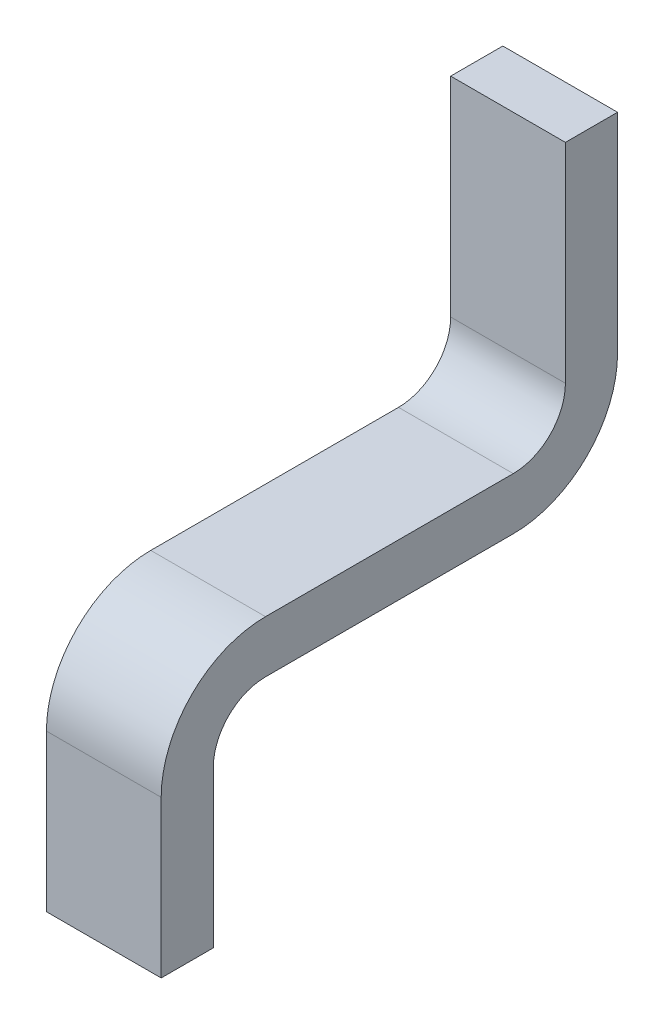
ISO-10303-21;
HEADER;
FILE_DESCRIPTION(('STEP AP214'),'2;1');
FILE_NAME('part.step','',(''),(''),'','','');
FILE_SCHEMA(('AUTOMOTIVE_DESIGN { 1 0 10303 214 1 1 1 1 }'));
ENDSEC;
DATA;
#1=APPLICATION_CONTEXT('core data for automotive mechanical design processes');
#2=APPLICATION_PROTOCOL_DEFINITION('international standard','automotive_design',2000,#1);
#3=PRODUCT_CONTEXT('',#1,'mechanical');
#4=PRODUCT('Part','Part','',(#3));
#5=PRODUCT_RELATED_PRODUCT_CATEGORY('part','',(#4));
#6=PRODUCT_DEFINITION_FORMATION('','',#4);
#7=PRODUCT_DEFINITION_CONTEXT('part definition',#1,'design');
#8=PRODUCT_DEFINITION('design','',#6,#7);
#9=PRODUCT_DEFINITION_SHAPE('','',#8);
#10=(LENGTH_UNIT() NAMED_UNIT(*) SI_UNIT(.MILLI.,.METRE.));
#11=(NAMED_UNIT(*) PLANE_ANGLE_UNIT() SI_UNIT($,.RADIAN.));
#12=(NAMED_UNIT(*) SI_UNIT($,.STERADIAN.) SOLID_ANGLE_UNIT());
#13=UNCERTAINTY_MEASURE_WITH_UNIT(LENGTH_MEASURE(1.E-05),#10,'distance_accuracy_value','');
#14=(GEOMETRIC_REPRESENTATION_CONTEXT(3) GLOBAL_UNCERTAINTY_ASSIGNED_CONTEXT((#13)) GLOBAL_UNIT_ASSIGNED_CONTEXT((#10,
#11,#12)) REPRESENTATION_CONTEXT('',''));
#15=CARTESIAN_POINT('',(0.,0.,0.));
#16=DIRECTION('',(0.,0.,1.));
#17=DIRECTION('',(1.,0.,0.));
#18=AXIS2_PLACEMENT_3D('',#15,#16,#17);
#19=CARTESIAN_POINT('',(-2.14,4.,0.675));
#20=DIRECTION('',(-1.,0.,0.));
#21=DIRECTION('',(0.,-1.,0.));
#22=AXIS2_PLACEMENT_3D('',#19,#20,#21);
#23=PLANE('',#22);
#24=CARTESIAN_POINT('',(-2.14,3.8,0.675));
#25=DIRECTION('',(1.,0.,0.));
#26=DIRECTION('',(0.,1.,0.));
#27=AXIS2_PLACEMENT_3D('',#24,#25,#26);
#28=CIRCLE('',#27,0.2);
#29=CARTESIAN_POINT('',(-2.14,3.8,0.875));
#30=VERTEX_POINT('',#29);
#31=CARTESIAN_POINT('',(-2.14,4.,0.675));
#32=VERTEX_POINT('',#31);
#33=EDGE_CURVE('E150',#30,#32,#28,.F.);
#34=ORIENTED_EDGE('',*,*,#33,.F.);
#35=DIRECTION('',(0.,1.,0.));
#36=VECTOR('',#35,1.);
#37=CARTESIAN_POINT('',(-2.14,3.5,0.875));
#38=LINE('',#37,#36);
#39=CARTESIAN_POINT('',(-2.14,3.5,0.875));
#40=VERTEX_POINT('',#39);
#41=EDGE_CURVE('E147',#30,#40,#38,.F.);
#42=ORIENTED_EDGE('',*,*,#41,.T.);
#43=DIRECTION('',(0.,0.,1.));
#44=VECTOR('',#43,1.);
#45=CARTESIAN_POINT('',(-2.14,3.5,0.775));
#46=LINE('',#45,#44);
#47=CARTESIAN_POINT('',(-2.14,3.5,0.775));
#48=VERTEX_POINT('',#47);
#49=EDGE_CURVE('E141',#48,#40,#46,.T.);
#50=ORIENTED_EDGE('',*,*,#49,.F.);
#51=DIRECTION('',(0.,1.,0.));
#52=VECTOR('',#51,1.);
#53=CARTESIAN_POINT('',(-2.14,3.5,0.775));
#54=LINE('',#53,#52);
#55=CARTESIAN_POINT('',(-2.14,3.8,0.775));
#56=VERTEX_POINT('',#55);
#57=EDGE_CURVE('E115',#48,#56,#54,.T.);
#58=ORIENTED_EDGE('',*,*,#57,.T.);
#59=CARTESIAN_POINT('',(-2.14,3.8,0.675));
#60=DIRECTION('',(1.,0.,0.));
#61=DIRECTION('',(0.,1.,0.));
#62=AXIS2_PLACEMENT_3D('',#59,#60,#61);
#63=CIRCLE('',#62,0.1);
#64=CARTESIAN_POINT('',(-2.14,3.9,0.675));
#65=VERTEX_POINT('',#64);
#66=EDGE_CURVE('E215',#56,#65,#63,.F.);
#67=ORIENTED_EDGE('',*,*,#66,.T.);
#68=DIRECTION('',(0.,0.,1.));
#69=VECTOR('',#68,1.);
#70=CARTESIAN_POINT('',(-2.14,3.9,0.675));
#71=LINE('',#70,#69);
#72=CARTESIAN_POINT('',(-2.14,3.9,0.2));
#73=VERTEX_POINT('',#72);
#74=EDGE_CURVE('E181',#65,#73,#71,.F.);
#75=ORIENTED_EDGE('',*,*,#74,.T.);
#76=CARTESIAN_POINT('',(-2.14,4.1,0.2));
#77=DIRECTION('',(-1.,0.,0.));
#78=DIRECTION('',(0.,-1.,0.));
#79=AXIS2_PLACEMENT_3D('',#76,#77,#78);
#80=CIRCLE('',#79,0.2);
#81=CARTESIAN_POINT('',(-2.14,4.1,0.));
#82=VERTEX_POINT('',#81);
#83=EDGE_CURVE('E20',#82,#73,#80,.T.);
#84=ORIENTED_EDGE('',*,*,#83,.F.);
#85=DIRECTION('',(0.,1.,0.));
#86=VECTOR('',#85,1.);
#87=CARTESIAN_POINT('',(-2.14,4.1,0.));
#88=LINE('',#87,#86);
#89=CARTESIAN_POINT('',(-2.14,4.5,0.));
#90=VERTEX_POINT('',#89);
#91=EDGE_CURVE('E91',#82,#90,#88,.T.);
#92=ORIENTED_EDGE('',*,*,#91,.T.);
#93=DIRECTION('',(0.,0.,1.));
#94=VECTOR('',#93,1.);
#95=CARTESIAN_POINT('',(-2.14,4.5,0.));
#96=LINE('',#95,#94);
#97=CARTESIAN_POINT('',(-2.14,4.5,0.1));
#98=VERTEX_POINT('',#97);
#99=EDGE_CURVE('E163',#90,#98,#96,.T.);
#100=ORIENTED_EDGE('',*,*,#99,.T.);
#101=DIRECTION('',(0.,1.,0.));
#102=VECTOR('',#101,1.);
#103=CARTESIAN_POINT('',(-2.14,4.1,0.1));
#104=LINE('',#103,#102);
#105=CARTESIAN_POINT('',(-2.14,4.1,0.1));
#106=VERTEX_POINT('',#105);
#107=EDGE_CURVE('E159',#98,#106,#104,.F.);
#108=ORIENTED_EDGE('',*,*,#107,.T.);
#109=CARTESIAN_POINT('',(-2.14,4.1,0.2));
#110=DIRECTION('',(-1.,0.,0.));
#111=DIRECTION('',(0.,-1.,0.));
#112=AXIS2_PLACEMENT_3D('',#109,#110,#111);
#113=CIRCLE('',#112,0.1);
#114=CARTESIAN_POINT('',(-2.14,4.,0.2));
#115=VERTEX_POINT('',#114);
#116=EDGE_CURVE('E155',#106,#115,#113,.T.);
#117=ORIENTED_EDGE('',*,*,#116,.T.);
#118=DIRECTION('',(0.,0.,1.));
#119=VECTOR('',#118,1.);
#120=CARTESIAN_POINT('',(-2.14,4.,0.675));
#121=LINE('',#120,#119);
#122=EDGE_CURVE('E154',#115,#32,#121,.T.);
#123=ORIENTED_EDGE('',*,*,#122,.T.);
#124=EDGE_LOOP('',(#34,#42,#50,#58,#67,#75,#84,#92,#100,#108,#117,#123));
#125=FACE_BOUND('',#124,.T.);
#126=ADVANCED_FACE('F17',(#125),#23,.F.);
#127=CARTESIAN_POINT('',(-2.14,4.1,0.2));
#128=DIRECTION('',(-1.,0.,0.));
#129=DIRECTION('',(0.,-1.,0.));
#130=AXIS2_PLACEMENT_3D('',#127,#128,#129);
#131=CYLINDRICAL_SURFACE('',#130,0.2);
#132=CARTESIAN_POINT('',(-2.36,4.1,0.2));
#133=DIRECTION('',(-1.,0.,0.));
#134=DIRECTION('',(0.,-1.,0.));
#135=AXIS2_PLACEMENT_3D('',#132,#133,#134);
#136=CIRCLE('',#135,0.2);
#137=CARTESIAN_POINT('',(-2.36,3.9,0.2));
#138=VERTEX_POINT('',#137);
#139=CARTESIAN_POINT('',(-2.36,4.1,0.));
#140=VERTEX_POINT('',#139);
#141=EDGE_CURVE('E183',#138,#140,#136,.F.);
#142=ORIENTED_EDGE('',*,*,#141,.T.);
#143=DIRECTION('',(1.,0.,0.));
#144=VECTOR('',#143,1.);
#145=CARTESIAN_POINT('',(-2.14,4.1,0.));
#146=LINE('',#145,#144);
#147=EDGE_CURVE('E178',#140,#82,#146,.T.);
#148=ORIENTED_EDGE('',*,*,#147,.T.);
#149=ORIENTED_EDGE('',*,*,#83,.T.);
#150=DIRECTION('',(-1.,0.,0.));
#151=VECTOR('',#150,1.);
#152=CARTESIAN_POINT('',(-2.14,3.9,0.2));
#153=LINE('',#152,#151);
#154=EDGE_CURVE('E217',#73,#138,#153,.T.);
#155=ORIENTED_EDGE('',*,*,#154,.T.);
#156=EDGE_LOOP('',(#142,#148,#149,#155));
#157=FACE_BOUND('',#156,.T.);
#158=ADVANCED_FACE('F254',(#157),#131,.T.);
#159=CARTESIAN_POINT('',(-2.14,4.1,0.));
#160=DIRECTION('',(0.,0.,1.));
#161=DIRECTION('',(1.,0.,0.));
#162=AXIS2_PLACEMENT_3D('',#159,#160,#161);
#163=PLANE('',#162);
#164=ORIENTED_EDGE('',*,*,#147,.F.);
#165=DIRECTION('',(0.,1.,0.));
#166=VECTOR('',#165,1.);
#167=CARTESIAN_POINT('',(-2.36,3.9,0.));
#168=LINE('',#167,#166);
#169=CARTESIAN_POINT('',(-2.36,4.5,0.));
#170=VERTEX_POINT('',#169);
#171=EDGE_CURVE('E170',#140,#170,#168,.T.);
#172=ORIENTED_EDGE('',*,*,#171,.T.);
#173=DIRECTION('',(1.,0.,0.));
#174=VECTOR('',#173,1.);
#175=CARTESIAN_POINT('',(-2.14,4.5,0.));
#176=LINE('',#175,#174);
#177=EDGE_CURVE('E173',#170,#90,#176,.T.);
#178=ORIENTED_EDGE('',*,*,#177,.T.);
#179=ORIENTED_EDGE('',*,*,#91,.F.);
#180=EDGE_LOOP('',(#164,#172,#178,#179));
#181=FACE_BOUND('',#180,.T.);
#182=ADVANCED_FACE('F257',(#181),#163,.F.);
#183=CARTESIAN_POINT('',(-2.14,4.5,0.));
#184=DIRECTION('',(0.,-1.,0.));
#185=DIRECTION('',(1.,0.,0.));
#186=AXIS2_PLACEMENT_3D('',#183,#184,#185);
#187=PLANE('',#186);
#188=DIRECTION('',(-1.,0.,0.));
#189=VECTOR('',#188,1.);
#190=CARTESIAN_POINT('',(-2.36,4.5,0.1));
#191=LINE('',#190,#189);
#192=CARTESIAN_POINT('',(-2.36,4.5,0.1));
#193=VERTEX_POINT('',#192);
#194=EDGE_CURVE('E160',#193,#98,#191,.F.);
#195=ORIENTED_EDGE('',*,*,#194,.T.);
#196=ORIENTED_EDGE('',*,*,#99,.F.);
#197=ORIENTED_EDGE('',*,*,#177,.F.);
#198=DIRECTION('',(0.,0.,1.));
#199=VECTOR('',#198,1.);
#200=CARTESIAN_POINT('',(-2.36,4.5,0.675));
#201=LINE('',#200,#199);
#202=EDGE_CURVE('E166',#170,#193,#201,.T.);
#203=ORIENTED_EDGE('',*,*,#202,.T.);
#204=EDGE_LOOP('',(#195,#196,#197,#203));
#205=FACE_BOUND('',#204,.T.);
#206=ADVANCED_FACE('F259',(#205),#187,.F.);
#207=CARTESIAN_POINT('',(-2.36,4.1,0.1));
#208=DIRECTION('',(0.,0.,-1.));
#209=DIRECTION('',(-1.,0.,0.));
#210=AXIS2_PLACEMENT_3D('',#207,#208,#209);
#211=PLANE('',#210);
#212=DIRECTION('',(-1.,0.,0.));
#213=VECTOR('',#212,1.);
#214=CARTESIAN_POINT('',(-2.36,4.1,0.1));
#215=LINE('',#214,#213);
#216=CARTESIAN_POINT('',(-2.36,4.1,0.1));
#217=VERTEX_POINT('',#216);
#218=EDGE_CURVE('E156',#217,#106,#215,.F.);
#219=ORIENTED_EDGE('',*,*,#218,.T.);
#220=ORIENTED_EDGE('',*,*,#107,.F.);
#221=ORIENTED_EDGE('',*,*,#194,.F.);
#222=DIRECTION('',(0.,1.,0.));
#223=VECTOR('',#222,1.);
#224=CARTESIAN_POINT('',(-2.36,3.9,0.1));
#225=LINE('',#224,#223);
#226=EDGE_CURVE('E169',#193,#217,#225,.F.);
#227=ORIENTED_EDGE('',*,*,#226,.T.);
#228=EDGE_LOOP('',(#219,#220,#221,#227));
#229=FACE_BOUND('',#228,.T.);
#230=ADVANCED_FACE('F234',(#229),#211,.F.);
#231=CARTESIAN_POINT('',(-2.36,4.1,0.2));
#232=DIRECTION('',(-1.,0.,0.));
#233=DIRECTION('',(0.,-1.,0.));
#234=AXIS2_PLACEMENT_3D('',#231,#232,#233);
#235=CYLINDRICAL_SURFACE('',#234,0.1);
#236=DIRECTION('',(1.,0.,0.));
#237=VECTOR('',#236,1.);
#238=CARTESIAN_POINT('',(-2.36,4.,0.2));
#239=LINE('',#238,#237);
#240=CARTESIAN_POINT('',(-2.36,4.,0.2));
#241=VERTEX_POINT('',#240);
#242=EDGE_CURVE('E151',#241,#115,#239,.T.);
#243=ORIENTED_EDGE('',*,*,#242,.T.);
#244=ORIENTED_EDGE('',*,*,#116,.F.);
#245=ORIENTED_EDGE('',*,*,#218,.F.);
#246=CARTESIAN_POINT('',(-2.36,4.1,0.2));
#247=DIRECTION('',(-1.,0.,0.));
#248=DIRECTION('',(0.,-1.,0.));
#249=AXIS2_PLACEMENT_3D('',#246,#247,#248);
#250=CIRCLE('',#249,0.1);
#251=EDGE_CURVE('E210',#217,#241,#250,.T.);
#252=ORIENTED_EDGE('',*,*,#251,.T.);
#253=EDGE_LOOP('',(#243,#244,#245,#252));
#254=FACE_BOUND('',#253,.T.);
#255=ADVANCED_FACE('F227',(#254),#235,.F.);
#256=CARTESIAN_POINT('',(-2.36,4.,0.675));
#257=DIRECTION('',(0.,-1.,0.));
#258=DIRECTION('',(1.,0.,0.));
#259=AXIS2_PLACEMENT_3D('',#256,#257,#258);
#260=PLANE('',#259);
#261=DIRECTION('',(1.,0.,0.));
#262=VECTOR('',#261,1.);
#263=CARTESIAN_POINT('',(-2.36,4.,0.675));
#264=LINE('',#263,#262);
#265=CARTESIAN_POINT('',(-2.36,4.,0.675));
#266=VERTEX_POINT('',#265);
#267=EDGE_CURVE('E148',#32,#266,#264,.F.);
#268=ORIENTED_EDGE('',*,*,#267,.F.);
#269=ORIENTED_EDGE('',*,*,#122,.F.);
#270=ORIENTED_EDGE('',*,*,#242,.F.);
#271=DIRECTION('',(0.,0.,1.));
#272=VECTOR('',#271,1.);
#273=CARTESIAN_POINT('',(-2.36,4.,0.675));
#274=LINE('',#273,#272);
#275=EDGE_CURVE('E209',#241,#266,#274,.T.);
#276=ORIENTED_EDGE('',*,*,#275,.T.);
#277=EDGE_LOOP('',(#268,#269,#270,#276));
#278=FACE_BOUND('',#277,.T.);
#279=ADVANCED_FACE('F224',(#278),#260,.F.);
#280=CARTESIAN_POINT('',(-2.36,3.8,0.675));
#281=DIRECTION('',(1.,0.,0.));
#282=DIRECTION('',(0.,1.,0.));
#283=AXIS2_PLACEMENT_3D('',#280,#281,#282);
#284=CYLINDRICAL_SURFACE('',#283,0.2);
#285=ORIENTED_EDGE('',*,*,#33,.T.);
#286=ORIENTED_EDGE('',*,*,#267,.T.);
#287=CARTESIAN_POINT('',(-2.36,3.8,0.675));
#288=DIRECTION('',(1.,0.,0.));
#289=DIRECTION('',(0.,1.,0.));
#290=AXIS2_PLACEMENT_3D('',#287,#288,#289);
#291=CIRCLE('',#290,0.2);
#292=CARTESIAN_POINT('',(-2.36,3.8,0.875));
#293=VERTEX_POINT('',#292);
#294=EDGE_CURVE('E133',#266,#293,#291,.T.);
#295=ORIENTED_EDGE('',*,*,#294,.T.);
#296=DIRECTION('',(-1.,0.,0.));
#297=VECTOR('',#296,1.);
#298=CARTESIAN_POINT('',(-2.36,3.8,0.875));
#299=LINE('',#298,#297);
#300=EDGE_CURVE('E144',#293,#30,#299,.F.);
#301=ORIENTED_EDGE('',*,*,#300,.T.);
#302=EDGE_LOOP('',(#285,#286,#295,#301));
#303=FACE_BOUND('',#302,.T.);
#304=ADVANCED_FACE('F285',(#303),#284,.T.);
#305=CARTESIAN_POINT('',(-2.36,3.5,0.875));
#306=DIRECTION('',(0.,0.,-1.));
#307=DIRECTION('',(-1.,0.,0.));
#308=AXIS2_PLACEMENT_3D('',#305,#306,#307);
#309=PLANE('',#308);
#310=DIRECTION('',(1.,0.,0.));
#311=VECTOR('',#310,1.);
#312=CARTESIAN_POINT('',(-2.14,3.5,0.875));
#313=LINE('',#312,#311);
#314=CARTESIAN_POINT('',(-2.36,3.5,0.875));
#315=VERTEX_POINT('',#314);
#316=EDGE_CURVE('E118',#40,#315,#313,.F.);
#317=ORIENTED_EDGE('',*,*,#316,.F.);
#318=ORIENTED_EDGE('',*,*,#41,.F.);
#319=ORIENTED_EDGE('',*,*,#300,.F.);
#320=DIRECTION('',(0.,1.,0.));
#321=VECTOR('',#320,1.);
#322=CARTESIAN_POINT('',(-2.36,3.9,0.875));
#323=LINE('',#322,#321);
#324=EDGE_CURVE('E131',#293,#315,#323,.F.);
#325=ORIENTED_EDGE('',*,*,#324,.T.);
#326=EDGE_LOOP('',(#317,#318,#319,#325));
#327=FACE_BOUND('',#326,.T.);
#328=ADVANCED_FACE('F282',(#327),#309,.F.);
#329=CARTESIAN_POINT('',(-2.14,3.5,0.775));
#330=DIRECTION('',(0.,-1.,0.));
#331=DIRECTION('',(1.,0.,0.));
#332=AXIS2_PLACEMENT_3D('',#329,#330,#331);
#333=PLANE('',#332);
#334=ORIENTED_EDGE('',*,*,#49,.T.);
#335=ORIENTED_EDGE('',*,*,#316,.T.);
#336=DIRECTION('',(0.,0.,1.));
#337=VECTOR('',#336,1.);
#338=CARTESIAN_POINT('',(-2.36,3.5,0.675));
#339=LINE('',#338,#337);
#340=CARTESIAN_POINT('',(-2.36,3.5,0.775));
#341=VERTEX_POINT('',#340);
#342=EDGE_CURVE('E125',#315,#341,#339,.F.);
#343=ORIENTED_EDGE('',*,*,#342,.T.);
#344=DIRECTION('',(1.,0.,0.));
#345=VECTOR('',#344,1.);
#346=CARTESIAN_POINT('',(-2.14,3.5,0.775));
#347=LINE('',#346,#345);
#348=EDGE_CURVE('E110',#341,#48,#347,.T.);
#349=ORIENTED_EDGE('',*,*,#348,.T.);
#350=EDGE_LOOP('',(#334,#335,#343,#349));
#351=FACE_BOUND('',#350,.T.);
#352=ADVANCED_FACE('F129',(#351),#333,.T.);
#353=CARTESIAN_POINT('',(-2.14,3.5,0.775));
#354=DIRECTION('',(0.,0.,1.));
#355=DIRECTION('',(1.,0.,0.));
#356=AXIS2_PLACEMENT_3D('',#353,#354,#355);
#357=PLANE('',#356);
#358=ORIENTED_EDGE('',*,*,#348,.F.);
#359=DIRECTION('',(0.,1.,0.));
#360=VECTOR('',#359,1.);
#361=CARTESIAN_POINT('',(-2.36,3.9,0.775));
#362=LINE('',#361,#360);
#363=CARTESIAN_POINT('',(-2.36,3.8,0.775));
#364=VERTEX_POINT('',#363);
#365=EDGE_CURVE('E114',#341,#364,#362,.T.);
#366=ORIENTED_EDGE('',*,*,#365,.T.);
#367=DIRECTION('',(1.,0.,0.));
#368=VECTOR('',#367,1.);
#369=CARTESIAN_POINT('',(-2.14,3.8,0.775));
#370=LINE('',#369,#368);
#371=EDGE_CURVE('E185',#364,#56,#370,.T.);
#372=ORIENTED_EDGE('',*,*,#371,.T.);
#373=ORIENTED_EDGE('',*,*,#57,.F.);
#374=EDGE_LOOP('',(#358,#366,#372,#373));
#375=FACE_BOUND('',#374,.T.);
#376=ADVANCED_FACE('F112',(#375),#357,.F.);
#377=CARTESIAN_POINT('',(-2.14,3.8,0.675));
#378=DIRECTION('',(1.,0.,0.));
#379=DIRECTION('',(0.,1.,0.));
#380=AXIS2_PLACEMENT_3D('',#377,#378,#379);
#381=CYLINDRICAL_SURFACE('',#380,0.1);
#382=ORIENTED_EDGE('',*,*,#371,.F.);
#383=CARTESIAN_POINT('',(-2.36,3.8,0.675));
#384=DIRECTION('',(1.,0.,0.));
#385=DIRECTION('',(0.,1.,0.));
#386=AXIS2_PLACEMENT_3D('',#383,#384,#385);
#387=CIRCLE('',#386,0.1);
#388=CARTESIAN_POINT('',(-2.36,3.9,0.675));
#389=VERTEX_POINT('',#388);
#390=EDGE_CURVE('E26',#364,#389,#387,.F.);
#391=ORIENTED_EDGE('',*,*,#390,.T.);
#392=DIRECTION('',(-1.,0.,0.));
#393=VECTOR('',#392,1.);
#394=CARTESIAN_POINT('',(-2.14,3.9,0.675));
#395=LINE('',#394,#393);
#396=EDGE_CURVE('E34',#389,#65,#395,.F.);
#397=ORIENTED_EDGE('',*,*,#396,.T.);
#398=ORIENTED_EDGE('',*,*,#66,.F.);
#399=EDGE_LOOP('',(#382,#391,#397,#398));
#400=FACE_BOUND('',#399,.T.);
#401=ADVANCED_FACE('F250',(#400),#381,.F.);
#402=CARTESIAN_POINT('',(-2.14,3.9,0.675));
#403=DIRECTION('',(0.,1.,0.));
#404=DIRECTION('',(-1.,0.,0.));
#405=AXIS2_PLACEMENT_3D('',#402,#403,#404);
#406=PLANE('',#405);
#407=ORIENTED_EDGE('',*,*,#396,.F.);
#408=DIRECTION('',(0.,0.,1.));
#409=VECTOR('',#408,1.);
#410=CARTESIAN_POINT('',(-2.36,3.9,0.675));
#411=LINE('',#410,#409);
#412=EDGE_CURVE('E11',#389,#138,#411,.F.);
#413=ORIENTED_EDGE('',*,*,#412,.T.);
#414=ORIENTED_EDGE('',*,*,#154,.F.);
#415=ORIENTED_EDGE('',*,*,#74,.F.);
#416=EDGE_LOOP('',(#407,#413,#414,#415));
#417=FACE_BOUND('',#416,.T.);
#418=ADVANCED_FACE('F252',(#417),#406,.F.);
#419=CARTESIAN_POINT('',(-2.36,3.9,0.675));
#420=DIRECTION('',(1.,0.,0.));
#421=DIRECTION('',(0.,1.,0.));
#422=AXIS2_PLACEMENT_3D('',#419,#420,#421);
#423=PLANE('',#422);
#424=ORIENTED_EDGE('',*,*,#390,.F.);
#425=ORIENTED_EDGE('',*,*,#365,.F.);
#426=ORIENTED_EDGE('',*,*,#342,.F.);
#427=ORIENTED_EDGE('',*,*,#324,.F.);
#428=ORIENTED_EDGE('',*,*,#294,.F.);
#429=ORIENTED_EDGE('',*,*,#275,.F.);
#430=ORIENTED_EDGE('',*,*,#251,.F.);
#431=ORIENTED_EDGE('',*,*,#226,.F.);
#432=ORIENTED_EDGE('',*,*,#202,.F.);
#433=ORIENTED_EDGE('',*,*,#171,.F.);
#434=ORIENTED_EDGE('',*,*,#141,.F.);
#435=ORIENTED_EDGE('',*,*,#412,.F.);
#436=EDGE_LOOP('',(#424,#425,#426,#427,#428,#429,#430,#431,#432,#433,#434,#435));
#437=FACE_BOUND('',#436,.T.);
#438=ADVANCED_FACE('F123',(#437),#423,.F.);
#439=CLOSED_SHELL('',(#126,#158,#182,#206,#230,#255,#279,#304,#328,#352,#376,#401,#418,#438));
#440=MANIFOLD_SOLID_BREP('B1',#439);
#441=ADVANCED_BREP_SHAPE_REPRESENTATION('',(#18,#440),#14);
#442=SHAPE_DEFINITION_REPRESENTATION(#9,#441);
ENDSEC;
END-ISO-10303-21;
